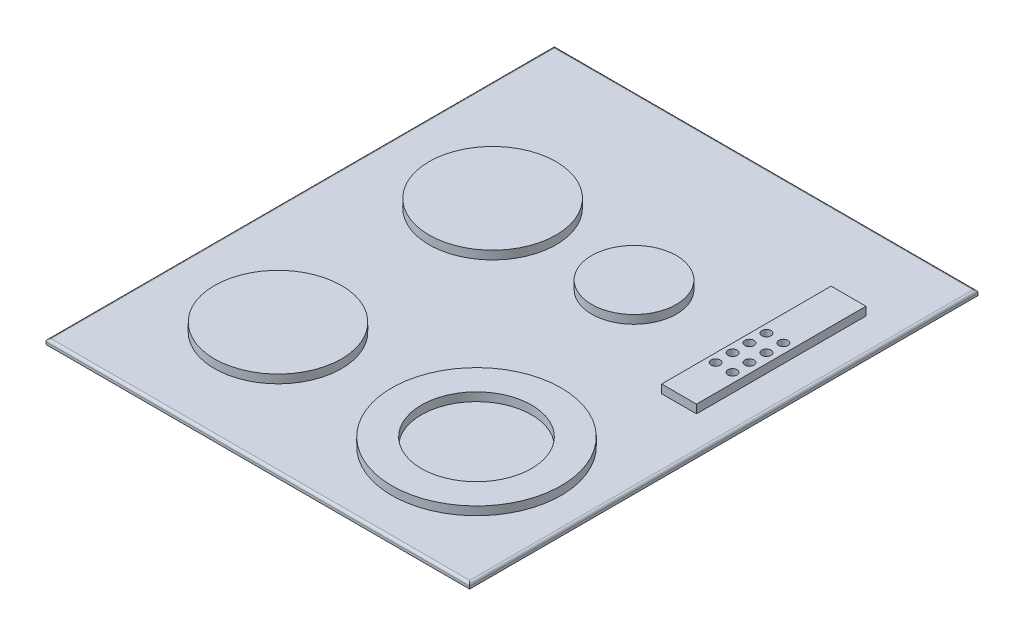
ISO-10303-21;
HEADER;
FILE_DESCRIPTION(('STEP AP214'),'2;1');
FILE_NAME('part.step','',(''),(''),'','','');
FILE_SCHEMA(('AUTOMOTIVE_DESIGN { 1 0 10303 214 1 1 1 1 }'));
ENDSEC;
DATA;
#1=APPLICATION_CONTEXT('core data for automotive mechanical design processes');
#2=APPLICATION_PROTOCOL_DEFINITION('international standard','automotive_design',2000,#1);
#3=PRODUCT_CONTEXT('',#1,'mechanical');
#4=PRODUCT('Part','Part','',(#3));
#5=PRODUCT_RELATED_PRODUCT_CATEGORY('part','',(#4));
#6=PRODUCT_DEFINITION_FORMATION('','',#4);
#7=PRODUCT_DEFINITION_CONTEXT('part definition',#1,'design');
#8=PRODUCT_DEFINITION('design','',#6,#7);
#9=PRODUCT_DEFINITION_SHAPE('','',#8);
#10=(LENGTH_UNIT() NAMED_UNIT(*) SI_UNIT(.MILLI.,.METRE.));
#11=(NAMED_UNIT(*) PLANE_ANGLE_UNIT() SI_UNIT($,.RADIAN.));
#12=(NAMED_UNIT(*) SI_UNIT($,.STERADIAN.) SOLID_ANGLE_UNIT());
#13=UNCERTAINTY_MEASURE_WITH_UNIT(LENGTH_MEASURE(1.E-05),#10,'distance_accuracy_value','');
#14=(GEOMETRIC_REPRESENTATION_CONTEXT(3) GLOBAL_UNCERTAINTY_ASSIGNED_CONTEXT((#13)) GLOBAL_UNIT_ASSIGNED_CONTEXT((#10,
#11,#12)) REPRESENTATION_CONTEXT('',''));
#15=CARTESIAN_POINT('',(0.,0.,0.));
#16=DIRECTION('',(0.,0.,1.));
#17=DIRECTION('',(1.,0.,0.));
#18=AXIS2_PLACEMENT_3D('',#15,#16,#17);
#19=CARTESIAN_POINT('',(0.,0.,0.));
#20=DIRECTION('',(0.,-1.,0.));
#21=DIRECTION('',(0.,0.,-1.));
#22=AXIS2_PLACEMENT_3D('',#19,#20,#21);
#23=PLANE('',#22);
#24=DIRECTION('',(0.,0.,1.));
#25=VECTOR('',#24,1.);
#26=CARTESIAN_POINT('',(0.,0.,0.));
#27=LINE('',#26,#25);
#28=CARTESIAN_POINT('',(0.,0.,-600.));
#29=VERTEX_POINT('',#28);
#30=CARTESIAN_POINT('',(0.,0.,0.));
#31=VERTEX_POINT('',#30);
#32=EDGE_CURVE('E271',#29,#31,#27,.T.);
#33=ORIENTED_EDGE('',*,*,#32,.F.);
#34=DIRECTION('',(-1.,0.,0.));
#35=VECTOR('',#34,1.);
#36=CARTESIAN_POINT('',(0.,0.,-600.));
#37=LINE('',#36,#35);
#38=CARTESIAN_POINT('',(500.,0.,-600.));
#39=VERTEX_POINT('',#38);
#40=EDGE_CURVE('E281',#39,#29,#37,.T.);
#41=ORIENTED_EDGE('',*,*,#40,.F.);
#42=DIRECTION('',(0.,0.,-1.));
#43=VECTOR('',#42,1.);
#44=CARTESIAN_POINT('',(500.,0.,0.));
#45=LINE('',#44,#43);
#46=CARTESIAN_POINT('',(500.,0.,0.));
#47=VERTEX_POINT('',#46);
#48=EDGE_CURVE('E278',#47,#39,#45,.T.);
#49=ORIENTED_EDGE('',*,*,#48,.F.);
#50=DIRECTION('',(1.,0.,0.));
#51=VECTOR('',#50,1.);
#52=CARTESIAN_POINT('',(0.,0.,0.));
#53=LINE('',#52,#51);
#54=EDGE_CURVE('E274',#31,#47,#53,.T.);
#55=ORIENTED_EDGE('',*,*,#54,.F.);
#56=EDGE_LOOP('',(#33,#41,#49,#55));
#57=FACE_BOUND('',#56,.T.);
#58=DIRECTION('',(0.,0.,1.));
#59=VECTOR('',#58,1.);
#60=CARTESIAN_POINT('',(450.,0.,0.));
#61=LINE('',#60,#59);
#62=CARTESIAN_POINT('',(450.,0.,-550.));
#63=VERTEX_POINT('',#62);
#64=CARTESIAN_POINT('',(450.,0.,-50.));
#65=VERTEX_POINT('',#64);
#66=EDGE_CURVE('E255',#63,#65,#61,.T.);
#67=ORIENTED_EDGE('',*,*,#66,.F.);
#68=DIRECTION('',(1.,0.,0.));
#69=VECTOR('',#68,1.);
#70=CARTESIAN_POINT('',(0.,0.,-550.));
#71=LINE('',#70,#69);
#72=CARTESIAN_POINT('',(50.0000000000001,0.,-550.));
#73=VERTEX_POINT('',#72);
#74=EDGE_CURVE('E241',#73,#63,#71,.T.);
#75=ORIENTED_EDGE('',*,*,#74,.F.);
#76=DIRECTION('',(0.,0.,-1.));
#77=VECTOR('',#76,1.);
#78=CARTESIAN_POINT('',(50.,0.,0.));
#79=LINE('',#78,#77);
#80=CARTESIAN_POINT('',(50.,0.,-50.));
#81=VERTEX_POINT('',#80);
#82=EDGE_CURVE('E246',#81,#73,#79,.T.);
#83=ORIENTED_EDGE('',*,*,#82,.F.);
#84=DIRECTION('',(-1.,0.,0.));
#85=VECTOR('',#84,1.);
#86=CARTESIAN_POINT('',(0.,0.,-50.));
#87=LINE('',#86,#85);
#88=EDGE_CURVE('E257',#65,#81,#87,.T.);
#89=ORIENTED_EDGE('',*,*,#88,.F.);
#90=EDGE_LOOP('',(#67,#75,#83,#89));
#91=FACE_BOUND('',#90,.T.);
#92=ADVANCED_FACE('F41',(#57,#91),#23,.T.);
#93=CARTESIAN_POINT('',(0.,6.,0.));
#94=DIRECTION('',(1.,0.,0.));
#95=DIRECTION('',(0.,0.,-1.));
#96=AXIS2_PLACEMENT_3D('',#93,#94,#95);
#97=PLANE('',#96);
#98=DIRECTION('',(0.,-1.,0.));
#99=VECTOR('',#98,1.);
#100=CARTESIAN_POINT('',(0.,6.,0.));
#101=LINE('',#100,#99);
#102=CARTESIAN_POINT('',(0.,3.,0.));
#103=VERTEX_POINT('',#102);
#104=EDGE_CURVE('E290',#103,#31,#101,.T.);
#105=ORIENTED_EDGE('',*,*,#104,.F.);
#106=DIRECTION('',(0.,0.,1.));
#107=VECTOR('',#106,1.);
#108=CARTESIAN_POINT('',(0.,3.,0.));
#109=LINE('',#108,#107);
#110=CARTESIAN_POINT('',(0.,3.,-600.));
#111=VERTEX_POINT('',#110);
#112=EDGE_CURVE('E308',#103,#111,#109,.F.);
#113=ORIENTED_EDGE('',*,*,#112,.T.);
#114=DIRECTION('',(0.,-1.,0.));
#115=VECTOR('',#114,1.);
#116=CARTESIAN_POINT('',(0.,6.,-600.));
#117=LINE('',#116,#115);
#118=EDGE_CURVE('E284',#111,#29,#117,.T.);
#119=ORIENTED_EDGE('',*,*,#118,.T.);
#120=ORIENTED_EDGE('',*,*,#32,.T.);
#121=EDGE_LOOP('',(#105,#113,#119,#120));
#122=FACE_BOUND('',#121,.T.);
#123=ADVANCED_FACE('F367',(#122),#97,.F.);
#124=CARTESIAN_POINT('',(0.,6.,0.));
#125=DIRECTION('',(0.,0.,-1.));
#126=DIRECTION('',(-1.,0.,0.));
#127=AXIS2_PLACEMENT_3D('',#124,#125,#126);
#128=PLANE('',#127);
#129=DIRECTION('',(0.,-1.,0.));
#130=VECTOR('',#129,1.);
#131=CARTESIAN_POINT('',(500.,6.,0.));
#132=LINE('',#131,#130);
#133=CARTESIAN_POINT('',(500.,3.,0.));
#134=VERTEX_POINT('',#133);
#135=EDGE_CURVE('E288',#134,#47,#132,.T.);
#136=ORIENTED_EDGE('',*,*,#135,.F.);
#137=DIRECTION('',(1.,0.,0.));
#138=VECTOR('',#137,1.);
#139=CARTESIAN_POINT('',(0.,3.,0.));
#140=LINE('',#139,#138);
#141=EDGE_CURVE('E306',#134,#103,#140,.F.);
#142=ORIENTED_EDGE('',*,*,#141,.T.);
#143=ORIENTED_EDGE('',*,*,#104,.T.);
#144=ORIENTED_EDGE('',*,*,#54,.T.);
#145=EDGE_LOOP('',(#136,#142,#143,#144));
#146=FACE_BOUND('',#145,.T.);
#147=ADVANCED_FACE('F364',(#146),#128,.F.);
#148=CARTESIAN_POINT('',(500.,6.,0.));
#149=DIRECTION('',(-1.,0.,0.));
#150=DIRECTION('',(0.,0.,1.));
#151=AXIS2_PLACEMENT_3D('',#148,#149,#150);
#152=PLANE('',#151);
#153=DIRECTION('',(0.,-1.,0.));
#154=VECTOR('',#153,1.);
#155=CARTESIAN_POINT('',(500.,6.,-600.));
#156=LINE('',#155,#154);
#157=CARTESIAN_POINT('',(500.,3.,-600.));
#158=VERTEX_POINT('',#157);
#159=EDGE_CURVE('E286',#158,#39,#156,.T.);
#160=ORIENTED_EDGE('',*,*,#159,.F.);
#161=DIRECTION('',(0.,0.,-1.));
#162=VECTOR('',#161,1.);
#163=CARTESIAN_POINT('',(500.,3.,0.));
#164=LINE('',#163,#162);
#165=EDGE_CURVE('E304',#158,#134,#164,.F.);
#166=ORIENTED_EDGE('',*,*,#165,.T.);
#167=ORIENTED_EDGE('',*,*,#135,.T.);
#168=ORIENTED_EDGE('',*,*,#48,.T.);
#169=EDGE_LOOP('',(#160,#166,#167,#168));
#170=FACE_BOUND('',#169,.T.);
#171=ADVANCED_FACE('F376',(#170),#152,.F.);
#172=CARTESIAN_POINT('',(0.,6.,-600.));
#173=DIRECTION('',(0.,0.,1.));
#174=DIRECTION('',(1.,0.,0.));
#175=AXIS2_PLACEMENT_3D('',#172,#173,#174);
#176=PLANE('',#175);
#177=ORIENTED_EDGE('',*,*,#118,.F.);
#178=DIRECTION('',(-1.,0.,0.));
#179=VECTOR('',#178,1.);
#180=CARTESIAN_POINT('',(0.,3.,-600.));
#181=LINE('',#180,#179);
#182=EDGE_CURVE('E301',#111,#158,#181,.F.);
#183=ORIENTED_EDGE('',*,*,#182,.T.);
#184=ORIENTED_EDGE('',*,*,#159,.T.);
#185=ORIENTED_EDGE('',*,*,#40,.T.);
#186=EDGE_LOOP('',(#177,#183,#184,#185));
#187=FACE_BOUND('',#186,.T.);
#188=ADVANCED_FACE('F333',(#187),#176,.F.);
#189=CARTESIAN_POINT('',(0.,6.,0.));
#190=DIRECTION('',(0.,-1.,0.));
#191=DIRECTION('',(0.,0.,-1.));
#192=AXIS2_PLACEMENT_3D('',#189,#190,#191);
#193=PLANE('',#192);
#194=DIRECTION('',(0.,0.,1.));
#195=VECTOR('',#194,1.);
#196=CARTESIAN_POINT('',(419.64670590059,6.,-507.));
#197=LINE('',#196,#195);
#198=CARTESIAN_POINT('',(419.64670590059,6.,-507.));
#199=VERTEX_POINT('',#198);
#200=CARTESIAN_POINT('',(419.64670590059,6.,-307.));
#201=VERTEX_POINT('',#200);
#202=EDGE_CURVE('E139',#199,#201,#197,.T.);
#203=ORIENTED_EDGE('',*,*,#202,.F.);
#204=DIRECTION('',(-1.,0.,0.));
#205=VECTOR('',#204,1.);
#206=CARTESIAN_POINT('',(419.64670590059,6.,-507.));
#207=LINE('',#206,#205);
#208=CARTESIAN_POINT('',(460.751235163329,6.,-507.));
#209=VERTEX_POINT('',#208);
#210=EDGE_CURVE('E143',#209,#199,#207,.T.);
#211=ORIENTED_EDGE('',*,*,#210,.F.);
#212=DIRECTION('',(0.,0.,-1.));
#213=VECTOR('',#212,1.);
#214=CARTESIAN_POINT('',(460.751235163329,6.,-507.));
#215=LINE('',#214,#213);
#216=CARTESIAN_POINT('',(460.751235163329,6.,-307.));
#217=VERTEX_POINT('',#216);
#218=EDGE_CURVE('E62',#217,#209,#215,.T.);
#219=ORIENTED_EDGE('',*,*,#218,.F.);
#220=DIRECTION('',(1.,0.,0.));
#221=VECTOR('',#220,1.);
#222=CARTESIAN_POINT('',(419.64670590059,6.,-307.));
#223=LINE('',#222,#221);
#224=EDGE_CURVE('E57',#201,#217,#223,.T.);
#225=ORIENTED_EDGE('',*,*,#224,.F.);
#226=EDGE_LOOP('',(#203,#211,#219,#225));
#227=FACE_BOUND('',#226,.T.);
#228=CARTESIAN_POINT('',(364.330089407844,6.,-143.740125968399));
#229=DIRECTION('',(0.,-1.,0.));
#230=DIRECTION('',(0.,0.,-1.));
#231=AXIS2_PLACEMENT_3D('',#228,#229,#230);
#232=CIRCLE('',#231,100.);
#233=CARTESIAN_POINT('',(364.330089407844,6.,-243.740125968399));
#234=VERTEX_POINT('',#233);
#235=EDGE_CURVE('E45',#234,#234,#232,.F.);
#236=ORIENTED_EDGE('',*,*,#235,.F.);
#237=EDGE_LOOP('',(#236));
#238=FACE_BOUND('',#237,.T.);
#239=CARTESIAN_POINT('',(130.089337479097,6.,-143.740125968399));
#240=DIRECTION('',(0.,-1.,0.));
#241=DIRECTION('',(0.,0.,-1.));
#242=AXIS2_PLACEMENT_3D('',#239,#240,#241);
#243=CIRCLE('',#242,75.);
#244=CARTESIAN_POINT('',(130.089337479097,6.,-218.740125968399));
#245=VERTEX_POINT('',#244);
#246=EDGE_CURVE('E323',#245,#245,#243,.F.);
#247=ORIENTED_EDGE('',*,*,#246,.F.);
#248=EDGE_LOOP('',(#247));
#249=FACE_BOUND('',#248,.T.);
#250=CARTESIAN_POINT('',(297.,6.,-397.));
#251=DIRECTION('',(0.,-1.,0.));
#252=DIRECTION('',(0.,0.,-1.));
#253=AXIS2_PLACEMENT_3D('',#250,#251,#252);
#254=CIRCLE('',#253,50.);
#255=CARTESIAN_POINT('',(297.,6.,-447.));
#256=VERTEX_POINT('',#255);
#257=EDGE_CURVE('E321',#256,#256,#254,.F.);
#258=ORIENTED_EDGE('',*,*,#257,.F.);
#259=EDGE_LOOP('',(#258));
#260=FACE_BOUND('',#259,.T.);
#261=CARTESIAN_POINT('',(130.089337479097,6.,-397.));
#262=DIRECTION('',(0.,-1.,0.));
#263=DIRECTION('',(0.,0.,-1.));
#264=AXIS2_PLACEMENT_3D('',#261,#262,#263);
#265=CIRCLE('',#264,75.);
#266=CARTESIAN_POINT('',(130.089337479097,6.,-472.));
#267=VERTEX_POINT('',#266);
#268=EDGE_CURVE('E310',#267,#267,#265,.F.);
#269=ORIENTED_EDGE('',*,*,#268,.F.);
#270=EDGE_LOOP('',(#269));
#271=FACE_BOUND('',#270,.T.);
#272=DIRECTION('',(0.,0.,-1.));
#273=VECTOR('',#272,1.);
#274=CARTESIAN_POINT('',(497.,6.,0.));
#275=LINE('',#274,#273);
#276=CARTESIAN_POINT('',(497.,6.,-3.));
#277=VERTEX_POINT('',#276);
#278=CARTESIAN_POINT('',(497.,6.,-597.));
#279=VERTEX_POINT('',#278);
#280=EDGE_CURVE('E296',#277,#279,#275,.T.);
#281=ORIENTED_EDGE('',*,*,#280,.T.);
#282=DIRECTION('',(-1.,0.,0.));
#283=VECTOR('',#282,1.);
#284=CARTESIAN_POINT('',(0.,6.,-597.));
#285=LINE('',#284,#283);
#286=CARTESIAN_POINT('',(3.,6.,-597.));
#287=VERTEX_POINT('',#286);
#288=EDGE_CURVE('E298',#279,#287,#285,.T.);
#289=ORIENTED_EDGE('',*,*,#288,.T.);
#290=DIRECTION('',(0.,0.,1.));
#291=VECTOR('',#290,1.);
#292=CARTESIAN_POINT('',(3.,6.,0.));
#293=LINE('',#292,#291);
#294=CARTESIAN_POINT('',(3.,6.,-3.));
#295=VERTEX_POINT('',#294);
#296=EDGE_CURVE('E292',#287,#295,#293,.T.);
#297=ORIENTED_EDGE('',*,*,#296,.T.);
#298=DIRECTION('',(1.,0.,0.));
#299=VECTOR('',#298,1.);
#300=CARTESIAN_POINT('',(0.,6.,-3.));
#301=LINE('',#300,#299);
#302=EDGE_CURVE('E294',#295,#277,#301,.T.);
#303=ORIENTED_EDGE('',*,*,#302,.T.);
#304=EDGE_LOOP('',(#281,#289,#297,#303));
#305=FACE_BOUND('',#304,.T.);
#306=ADVANCED_FACE('F141',(#227,#238,#249,#260,#271,#305),#193,.F.);
#307=CARTESIAN_POINT('',(0.,3.,-3.));
#308=DIRECTION('',(1.,0.,0.));
#309=DIRECTION('',(0.,0.,-1.));
#310=AXIS2_PLACEMENT_3D('',#307,#308,#309);
#311=CYLINDRICAL_SURFACE('',#310,3.);
#312=CARTESIAN_POINT('',(3.,3.,-3.));
#313=DIRECTION('',(0.707106781186547,0.,0.707106781186547));
#314=DIRECTION('',(-0.707106781186547,0.,0.707106781186547));
#315=AXIS2_PLACEMENT_3D('',#312,#313,#314);
#316=ELLIPSE('',#315,4.24264068711928,3.);
#317=EDGE_CURVE('E314',#103,#295,#316,.F.);
#318=ORIENTED_EDGE('',*,*,#317,.F.);
#319=ORIENTED_EDGE('',*,*,#141,.F.);
#320=CARTESIAN_POINT('',(497.,3.,-3.));
#321=DIRECTION('',(0.707106781186547,0.,-0.707106781186547));
#322=DIRECTION('',(0.707106781186547,0.,0.707106781186547));
#323=AXIS2_PLACEMENT_3D('',#320,#321,#322);
#324=ELLIPSE('',#323,4.24264068711928,3.);
#325=EDGE_CURVE('E275',#277,#134,#324,.T.);
#326=ORIENTED_EDGE('',*,*,#325,.F.);
#327=ORIENTED_EDGE('',*,*,#302,.F.);
#328=EDGE_LOOP('',(#318,#319,#326,#327));
#329=FACE_BOUND('',#328,.T.);
#330=ADVANCED_FACE('F43',(#329),#311,.T.);
#331=CARTESIAN_POINT('',(497.,3.,0.));
#332=DIRECTION('',(0.,0.,-1.));
#333=DIRECTION('',(-1.,0.,0.));
#334=AXIS2_PLACEMENT_3D('',#331,#332,#333);
#335=CYLINDRICAL_SURFACE('',#334,3.);
#336=ORIENTED_EDGE('',*,*,#325,.T.);
#337=ORIENTED_EDGE('',*,*,#165,.F.);
#338=CARTESIAN_POINT('',(497.,3.,-597.));
#339=DIRECTION('',(-0.707106781186547,0.,-0.707106781186547));
#340=DIRECTION('',(0.707106781186547,0.,-0.707106781186547));
#341=AXIS2_PLACEMENT_3D('',#338,#339,#340);
#342=ELLIPSE('',#341,4.24264068711928,3.);
#343=EDGE_CURVE('E312',#279,#158,#342,.T.);
#344=ORIENTED_EDGE('',*,*,#343,.F.);
#345=ORIENTED_EDGE('',*,*,#280,.F.);
#346=EDGE_LOOP('',(#336,#337,#344,#345));
#347=FACE_BOUND('',#346,.T.);
#348=ADVANCED_FACE('F349',(#347),#335,.T.);
#349=CARTESIAN_POINT('',(3.,3.,0.));
#350=DIRECTION('',(0.,0.,1.));
#351=DIRECTION('',(1.,0.,0.));
#352=AXIS2_PLACEMENT_3D('',#349,#350,#351);
#353=CYLINDRICAL_SURFACE('',#352,3.);
#354=ORIENTED_EDGE('',*,*,#317,.T.);
#355=ORIENTED_EDGE('',*,*,#296,.F.);
#356=CARTESIAN_POINT('',(3.,3.,-597.));
#357=DIRECTION('',(-0.707106781186547,0.,0.707106781186547));
#358=DIRECTION('',(0.707106781186547,0.,0.707106781186547));
#359=AXIS2_PLACEMENT_3D('',#356,#357,#358);
#360=ELLIPSE('',#359,4.24264068711928,3.);
#361=EDGE_CURVE('E270',#111,#287,#360,.F.);
#362=ORIENTED_EDGE('',*,*,#361,.F.);
#363=ORIENTED_EDGE('',*,*,#112,.F.);
#364=EDGE_LOOP('',(#354,#355,#362,#363));
#365=FACE_BOUND('',#364,.T.);
#366=ADVANCED_FACE('F357',(#365),#353,.T.);
#367=CARTESIAN_POINT('',(0.,3.,-597.));
#368=DIRECTION('',(-1.,0.,0.));
#369=DIRECTION('',(0.,0.,1.));
#370=AXIS2_PLACEMENT_3D('',#367,#368,#369);
#371=CYLINDRICAL_SURFACE('',#370,3.);
#372=ORIENTED_EDGE('',*,*,#343,.T.);
#373=ORIENTED_EDGE('',*,*,#182,.F.);
#374=ORIENTED_EDGE('',*,*,#361,.T.);
#375=ORIENTED_EDGE('',*,*,#288,.F.);
#376=EDGE_LOOP('',(#372,#373,#374,#375));
#377=FACE_BOUND('',#376,.T.);
#378=ADVANCED_FACE('F352',(#377),#371,.T.);
#379=CARTESIAN_POINT('',(0.,-26.,-550.));
#380=DIRECTION('',(0.,0.,1.));
#381=DIRECTION('',(1.,0.,0.));
#382=AXIS2_PLACEMENT_3D('',#379,#380,#381);
#383=PLANE('',#382);
#384=ORIENTED_EDGE('',*,*,#74,.T.);
#385=DIRECTION('',(0.,1.,0.));
#386=VECTOR('',#385,1.);
#387=CARTESIAN_POINT('',(450.,-26.,-550.));
#388=LINE('',#387,#386);
#389=CARTESIAN_POINT('',(450.,-26.,-550.));
#390=VERTEX_POINT('',#389);
#391=EDGE_CURVE('E268',#390,#63,#388,.T.);
#392=ORIENTED_EDGE('',*,*,#391,.F.);
#393=DIRECTION('',(1.,0.,0.));
#394=VECTOR('',#393,1.);
#395=CARTESIAN_POINT('',(0.,-26.,-550.));
#396=LINE('',#395,#394);
#397=CARTESIAN_POINT('',(50.0000000000001,-26.,-550.));
#398=VERTEX_POINT('',#397);
#399=EDGE_CURVE('E242',#398,#390,#396,.T.);
#400=ORIENTED_EDGE('',*,*,#399,.F.);
#401=DIRECTION('',(0.,1.,0.));
#402=VECTOR('',#401,1.);
#403=CARTESIAN_POINT('',(50.0000000000001,-26.,-550.));
#404=LINE('',#403,#402);
#405=EDGE_CURVE('E252',#398,#73,#404,.T.);
#406=ORIENTED_EDGE('',*,*,#405,.T.);
#407=EDGE_LOOP('',(#384,#392,#400,#406));
#408=FACE_BOUND('',#407,.T.);
#409=ADVANCED_FACE('F391',(#408),#383,.F.);
#410=CARTESIAN_POINT('',(450.,-26.,0.));
#411=DIRECTION('',(-1.,0.,0.));
#412=DIRECTION('',(0.,0.,1.));
#413=AXIS2_PLACEMENT_3D('',#410,#411,#412);
#414=PLANE('',#413);
#415=ORIENTED_EDGE('',*,*,#66,.T.);
#416=DIRECTION('',(0.,1.,0.));
#417=VECTOR('',#416,1.);
#418=CARTESIAN_POINT('',(450.,-26.,-50.));
#419=LINE('',#418,#417);
#420=CARTESIAN_POINT('',(450.,-26.,-50.));
#421=VERTEX_POINT('',#420);
#422=EDGE_CURVE('E265',#421,#65,#419,.T.);
#423=ORIENTED_EDGE('',*,*,#422,.F.);
#424=DIRECTION('',(0.,0.,1.));
#425=VECTOR('',#424,1.);
#426=CARTESIAN_POINT('',(450.,-26.,0.));
#427=LINE('',#426,#425);
#428=EDGE_CURVE('E245',#390,#421,#427,.T.);
#429=ORIENTED_EDGE('',*,*,#428,.F.);
#430=ORIENTED_EDGE('',*,*,#391,.T.);
#431=EDGE_LOOP('',(#415,#423,#429,#430));
#432=FACE_BOUND('',#431,.T.);
#433=ADVANCED_FACE('F394',(#432),#414,.F.);
#434=CARTESIAN_POINT('',(0.,-26.,-50.));
#435=DIRECTION('',(0.,0.,-1.));
#436=DIRECTION('',(-1.,0.,0.));
#437=AXIS2_PLACEMENT_3D('',#434,#435,#436);
#438=PLANE('',#437);
#439=ORIENTED_EDGE('',*,*,#88,.T.);
#440=DIRECTION('',(0.,1.,0.));
#441=VECTOR('',#440,1.);
#442=CARTESIAN_POINT('',(50.,-26.,-50.));
#443=LINE('',#442,#441);
#444=CARTESIAN_POINT('',(50.,-26.,-50.));
#445=VERTEX_POINT('',#444);
#446=EDGE_CURVE('E263',#445,#81,#443,.T.);
#447=ORIENTED_EDGE('',*,*,#446,.F.);
#448=DIRECTION('',(-1.,0.,0.));
#449=VECTOR('',#448,1.);
#450=CARTESIAN_POINT('',(0.,-26.,-50.));
#451=LINE('',#450,#449);
#452=EDGE_CURVE('E248',#421,#445,#451,.T.);
#453=ORIENTED_EDGE('',*,*,#452,.F.);
#454=ORIENTED_EDGE('',*,*,#422,.T.);
#455=EDGE_LOOP('',(#439,#447,#453,#454));
#456=FACE_BOUND('',#455,.T.);
#457=ADVANCED_FACE('F398',(#456),#438,.F.);
#458=CARTESIAN_POINT('',(50.,-26.,0.));
#459=DIRECTION('',(1.,0.,0.));
#460=DIRECTION('',(0.,0.,-1.));
#461=AXIS2_PLACEMENT_3D('',#458,#459,#460);
#462=PLANE('',#461);
#463=ORIENTED_EDGE('',*,*,#82,.T.);
#464=ORIENTED_EDGE('',*,*,#405,.F.);
#465=DIRECTION('',(0.,0.,-1.));
#466=VECTOR('',#465,1.);
#467=CARTESIAN_POINT('',(50.,-26.,0.));
#468=LINE('',#467,#466);
#469=EDGE_CURVE('E250',#445,#398,#468,.T.);
#470=ORIENTED_EDGE('',*,*,#469,.F.);
#471=ORIENTED_EDGE('',*,*,#446,.T.);
#472=EDGE_LOOP('',(#463,#464,#470,#471));
#473=FACE_BOUND('',#472,.T.);
#474=ADVANCED_FACE('F402',(#473),#462,.F.);
#475=CARTESIAN_POINT('',(0.,-26.,0.));
#476=DIRECTION('',(0.,-1.,0.));
#477=DIRECTION('',(0.,0.,-1.));
#478=AXIS2_PLACEMENT_3D('',#475,#476,#477);
#479=PLANE('',#478);
#480=CARTESIAN_POINT('',(250.,-26.,-300.));
#481=DIRECTION('',(0.,-1.,0.));
#482=DIRECTION('',(0.,0.,-1.));
#483=AXIS2_PLACEMENT_3D('',#480,#481,#482);
#484=CIRCLE('',#483,53.966181138013);
#485=CARTESIAN_POINT('',(250.,-26.,-353.966181138013));
#486=VERTEX_POINT('',#485);
#487=EDGE_CURVE('E11',#486,#486,#484,.T.);
#488=ORIENTED_EDGE('',*,*,#487,.F.);
#489=EDGE_LOOP('',(#488));
#490=FACE_BOUND('',#489,.T.);
#491=ORIENTED_EDGE('',*,*,#399,.T.);
#492=ORIENTED_EDGE('',*,*,#428,.T.);
#493=ORIENTED_EDGE('',*,*,#452,.T.);
#494=ORIENTED_EDGE('',*,*,#469,.T.);
#495=EDGE_LOOP('',(#491,#492,#493,#494));
#496=FACE_BOUND('',#495,.T.);
#497=ADVANCED_FACE('F406',(#490,#496),#479,.T.);
#498=CARTESIAN_POINT('',(130.089337479097,16.,-397.));
#499=DIRECTION('',(0.,-1.,0.));
#500=DIRECTION('',(0.,0.,-1.));
#501=AXIS2_PLACEMENT_3D('',#498,#499,#500);
#502=CYLINDRICAL_SURFACE('',#501,75.);
#503=CARTESIAN_POINT('',(130.089337479097,16.,-397.));
#504=DIRECTION('',(0.,1.,0.));
#505=DIRECTION('',(0.,0.,1.));
#506=AXIS2_PLACEMENT_3D('',#503,#504,#505);
#507=CIRCLE('',#506,75.);
#508=CARTESIAN_POINT('',(130.089337479097,16.,-322.));
#509=VERTEX_POINT('',#508);
#510=EDGE_CURVE('E238',#509,#509,#507,.T.);
#511=ORIENTED_EDGE('',*,*,#510,.F.);
#512=EDGE_LOOP('',(#511));
#513=FACE_BOUND('',#512,.T.);
#514=ORIENTED_EDGE('',*,*,#268,.T.);
#515=EDGE_LOOP('',(#514));
#516=FACE_BOUND('',#515,.T.);
#517=ADVANCED_FACE('F410',(#513,#516),#502,.T.);
#518=CARTESIAN_POINT('',(130.089337479097,16.,-397.));
#519=DIRECTION('',(0.,1.,0.));
#520=DIRECTION('',(0.,0.,1.));
#521=AXIS2_PLACEMENT_3D('',#518,#519,#520);
#522=PLANE('',#521);
#523=ORIENTED_EDGE('',*,*,#510,.T.);
#524=EDGE_LOOP('',(#523));
#525=FACE_BOUND('',#524,.T.);
#526=ADVANCED_FACE('F414',(#525),#522,.T.);
#527=CARTESIAN_POINT('',(297.,16.,-397.));
#528=DIRECTION('',(0.,-1.,0.));
#529=DIRECTION('',(0.,0.,-1.));
#530=AXIS2_PLACEMENT_3D('',#527,#528,#529);
#531=CYLINDRICAL_SURFACE('',#530,50.);
#532=CARTESIAN_POINT('',(297.,16.,-397.));
#533=DIRECTION('',(0.,1.,0.));
#534=DIRECTION('',(0.,0.,1.));
#535=AXIS2_PLACEMENT_3D('',#532,#533,#534);
#536=CIRCLE('',#535,50.);
#537=CARTESIAN_POINT('',(297.,16.,-347.));
#538=VERTEX_POINT('',#537);
#539=EDGE_CURVE('E235',#538,#538,#536,.T.);
#540=ORIENTED_EDGE('',*,*,#539,.F.);
#541=EDGE_LOOP('',(#540));
#542=FACE_BOUND('',#541,.T.);
#543=ORIENTED_EDGE('',*,*,#257,.T.);
#544=EDGE_LOOP('',(#543));
#545=FACE_BOUND('',#544,.T.);
#546=ADVANCED_FACE('F418',(#542,#545),#531,.T.);
#547=CARTESIAN_POINT('',(297.,16.,-397.));
#548=DIRECTION('',(0.,1.,0.));
#549=DIRECTION('',(0.,0.,1.));
#550=AXIS2_PLACEMENT_3D('',#547,#548,#549);
#551=PLANE('',#550);
#552=ORIENTED_EDGE('',*,*,#539,.T.);
#553=EDGE_LOOP('',(#552));
#554=FACE_BOUND('',#553,.T.);
#555=ADVANCED_FACE('F420',(#554),#551,.T.);
#556=CARTESIAN_POINT('',(130.089337479097,16.,-143.740125968399));
#557=DIRECTION('',(0.,-1.,0.));
#558=DIRECTION('',(0.,0.,-1.));
#559=AXIS2_PLACEMENT_3D('',#556,#557,#558);
#560=CYLINDRICAL_SURFACE('',#559,75.);
#561=CARTESIAN_POINT('',(130.089337479097,16.,-143.740125968399));
#562=DIRECTION('',(0.,1.,0.));
#563=DIRECTION('',(0.,0.,1.));
#564=AXIS2_PLACEMENT_3D('',#561,#562,#563);
#565=CIRCLE('',#564,75.);
#566=CARTESIAN_POINT('',(130.089337479097,16.,-68.7401259683994));
#567=VERTEX_POINT('',#566);
#568=EDGE_CURVE('E230',#567,#567,#565,.T.);
#569=ORIENTED_EDGE('',*,*,#568,.F.);
#570=EDGE_LOOP('',(#569));
#571=FACE_BOUND('',#570,.T.);
#572=ORIENTED_EDGE('',*,*,#246,.T.);
#573=EDGE_LOOP('',(#572));
#574=FACE_BOUND('',#573,.T.);
#575=ADVANCED_FACE('F423',(#571,#574),#560,.T.);
#576=CARTESIAN_POINT('',(130.089337479097,16.,-143.740125968399));
#577=DIRECTION('',(0.,1.,0.));
#578=DIRECTION('',(0.,0.,1.));
#579=AXIS2_PLACEMENT_3D('',#576,#577,#578);
#580=PLANE('',#579);
#581=ORIENTED_EDGE('',*,*,#568,.T.);
#582=EDGE_LOOP('',(#581));
#583=FACE_BOUND('',#582,.T.);
#584=ADVANCED_FACE('F428',(#583),#580,.T.);
#585=CARTESIAN_POINT('',(364.330089407844,16.,-143.740125968399));
#586=DIRECTION('',(0.,1.,0.));
#587=DIRECTION('',(0.,0.,1.));
#588=AXIS2_PLACEMENT_3D('',#585,#586,#587);
#589=PLANE('',#588);
#590=CARTESIAN_POINT('',(364.330089407844,16.,-143.740125968399));
#591=DIRECTION('',(0.,1.,0.));
#592=DIRECTION('',(0.,0.,1.));
#593=AXIS2_PLACEMENT_3D('',#590,#591,#592);
#594=CIRCLE('',#593,100.);
#595=CARTESIAN_POINT('',(364.330089407844,16.,-43.7401259683995));
#596=VERTEX_POINT('',#595);
#597=EDGE_CURVE('E221',#596,#596,#594,.T.);
#598=ORIENTED_EDGE('',*,*,#597,.T.);
#599=EDGE_LOOP('',(#598));
#600=FACE_BOUND('',#599,.T.);
#601=CARTESIAN_POINT('',(364.330089407844,16.,-143.740125968399));
#602=DIRECTION('',(0.,1.,0.));
#603=DIRECTION('',(0.,0.,1.));
#604=AXIS2_PLACEMENT_3D('',#601,#602,#603);
#605=CIRCLE('',#604,65.);
#606=CARTESIAN_POINT('',(364.330089407844,16.,-78.7401259683995));
#607=VERTEX_POINT('',#606);
#608=EDGE_CURVE('E226',#607,#607,#605,.T.);
#609=ORIENTED_EDGE('',*,*,#608,.F.);
#610=EDGE_LOOP('',(#609));
#611=FACE_BOUND('',#610,.T.);
#612=ADVANCED_FACE('F431',(#600,#611),#589,.T.);
#613=CARTESIAN_POINT('',(364.330089407844,16.,-143.740125968399));
#614=DIRECTION('',(0.,-1.,0.));
#615=DIRECTION('',(0.,0.,-1.));
#616=AXIS2_PLACEMENT_3D('',#613,#614,#615);
#617=CYLINDRICAL_SURFACE('',#616,100.);
#618=ORIENTED_EDGE('',*,*,#597,.F.);
#619=EDGE_LOOP('',(#618));
#620=FACE_BOUND('',#619,.T.);
#621=ORIENTED_EDGE('',*,*,#235,.T.);
#622=EDGE_LOOP('',(#621));
#623=FACE_BOUND('',#622,.T.);
#624=ADVANCED_FACE('F330',(#620,#623),#617,.T.);
#625=CARTESIAN_POINT('',(364.330089407844,16.,-143.740125968399));
#626=DIRECTION('',(0.,-1.,0.));
#627=DIRECTION('',(0.,0.,-1.));
#628=AXIS2_PLACEMENT_3D('',#625,#626,#627);
#629=CYLINDRICAL_SURFACE('',#628,65.);
#630=ORIENTED_EDGE('',*,*,#608,.T.);
#631=EDGE_LOOP('',(#630));
#632=FACE_BOUND('',#631,.T.);
#633=CARTESIAN_POINT('',(364.330089407844,6.,-143.740125968399));
#634=DIRECTION('',(0.,1.,0.));
#635=DIRECTION('',(0.,0.,1.));
#636=AXIS2_PLACEMENT_3D('',#633,#634,#635);
#637=CIRCLE('',#636,65.);
#638=CARTESIAN_POINT('',(364.330089407844,6.,-78.7401259683995));
#639=VERTEX_POINT('',#638);
#640=EDGE_CURVE('E227',#639,#639,#637,.T.);
#641=ORIENTED_EDGE('',*,*,#640,.F.);
#642=EDGE_LOOP('',(#641));
#643=FACE_BOUND('',#642,.T.);
#644=ADVANCED_FACE('F436',(#632,#643),#629,.F.);
#645=ORIENTED_EDGE('',*,*,#640,.T.);
#646=EDGE_LOOP('',(#645));
#647=FACE_BOUND('',#646,.T.);
#648=ADVANCED_FACE('F336',(#647),#193,.F.);
#649=CARTESIAN_POINT('',(0.,16.,0.));
#650=DIRECTION('',(0.,1.,0.));
#651=DIRECTION('',(0.,0.,1.));
#652=AXIS2_PLACEMENT_3D('',#649,#650,#651);
#653=PLANE('',#652);
#654=CARTESIAN_POINT('',(449.543954361207,16.,-380.752043300588));
#655=DIRECTION('',(0.,1.,0.));
#656=DIRECTION('',(0.,0.,1.));
#657=AXIS2_PLACEMENT_3D('',#654,#655,#656);
#658=CIRCLE('',#657,5.39941650934308);
#659=CARTESIAN_POINT('',(449.543954361207,16.,-375.352626791245));
#660=VERTEX_POINT('',#659);
#661=EDGE_CURVE('E209',#660,#660,#658,.T.);
#662=ORIENTED_EDGE('',*,*,#661,.F.);
#663=EDGE_LOOP('',(#662));
#664=FACE_BOUND('',#663,.T.);
#665=CARTESIAN_POINT('',(429.543954361207,16.,-360.752043300588));
#666=DIRECTION('',(0.,1.,0.));
#667=DIRECTION('',(0.,0.,1.));
#668=AXIS2_PLACEMENT_3D('',#665,#666,#667);
#669=CIRCLE('',#668,5.39941650934309);
#670=CARTESIAN_POINT('',(429.543954361207,16.,-355.352626791245));
#671=VERTEX_POINT('',#670);
#672=EDGE_CURVE('E197',#671,#671,#669,.T.);
#673=ORIENTED_EDGE('',*,*,#672,.F.);
#674=EDGE_LOOP('',(#673));
#675=FACE_BOUND('',#674,.T.);
#676=CARTESIAN_POINT('',(429.543954361206,16.,-400.752043300588));
#677=DIRECTION('',(0.,1.,0.));
#678=DIRECTION('',(0.,0.,1.));
#679=AXIS2_PLACEMENT_3D('',#676,#677,#678);
#680=CIRCLE('',#679,5.39941650934308);
#681=CARTESIAN_POINT('',(429.543954361206,16.,-395.352626791245));
#682=VERTEX_POINT('',#681);
#683=EDGE_CURVE('E185',#682,#682,#680,.T.);
#684=ORIENTED_EDGE('',*,*,#683,.F.);
#685=EDGE_LOOP('',(#684));
#686=FACE_BOUND('',#685,.T.);
#687=CARTESIAN_POINT('',(449.543954361206,16.,-420.752043300588));
#688=DIRECTION('',(0.,1.,0.));
#689=DIRECTION('',(0.,0.,1.));
#690=AXIS2_PLACEMENT_3D('',#687,#688,#689);
#691=CIRCLE('',#690,5.39941650934308);
#692=CARTESIAN_POINT('',(449.543954361206,16.,-415.352626791245));
#693=VERTEX_POINT('',#692);
#694=EDGE_CURVE('E147',#693,#693,#691,.T.);
#695=ORIENTED_EDGE('',*,*,#694,.F.);
#696=EDGE_LOOP('',(#695));
#697=FACE_BOUND('',#696,.T.);
#698=DIRECTION('',(0.,0.,1.));
#699=VECTOR('',#698,1.);
#700=CARTESIAN_POINT('',(419.64670590059,16.,-507.));
#701=LINE('',#700,#699);
#702=CARTESIAN_POINT('',(419.64670590059,16.,-507.));
#703=VERTEX_POINT('',#702);
#704=CARTESIAN_POINT('',(419.64670590059,16.,-307.));
#705=VERTEX_POINT('',#704);
#706=EDGE_CURVE('E158',#703,#705,#701,.T.);
#707=ORIENTED_EDGE('',*,*,#706,.T.);
#708=DIRECTION('',(1.,0.,0.));
#709=VECTOR('',#708,1.);
#710=CARTESIAN_POINT('',(419.64670590059,16.,-307.));
#711=LINE('',#710,#709);
#712=CARTESIAN_POINT('',(460.751235163329,16.,-307.));
#713=VERTEX_POINT('',#712);
#714=EDGE_CURVE('E173',#705,#713,#711,.T.);
#715=ORIENTED_EDGE('',*,*,#714,.T.);
#716=DIRECTION('',(0.,0.,-1.));
#717=VECTOR('',#716,1.);
#718=CARTESIAN_POINT('',(460.751235163329,16.,-507.));
#719=LINE('',#718,#717);
#720=CARTESIAN_POINT('',(460.751235163329,16.,-507.));
#721=VERTEX_POINT('',#720);
#722=EDGE_CURVE('E164',#713,#721,#719,.T.);
#723=ORIENTED_EDGE('',*,*,#722,.T.);
#724=DIRECTION('',(-1.,0.,0.));
#725=VECTOR('',#724,1.);
#726=CARTESIAN_POINT('',(419.64670590059,16.,-507.));
#727=LINE('',#726,#725);
#728=EDGE_CURVE('E162',#721,#703,#727,.T.);
#729=ORIENTED_EDGE('',*,*,#728,.T.);
#730=EDGE_LOOP('',(#707,#715,#723,#729));
#731=FACE_BOUND('',#730,.T.);
#732=CARTESIAN_POINT('',(429.543954361206,16.,-420.752043300588));
#733=DIRECTION('',(0.,1.,0.));
#734=DIRECTION('',(0.,0.,1.));
#735=AXIS2_PLACEMENT_3D('',#732,#733,#734);
#736=CIRCLE('',#735,5.39941650934308);
#737=CARTESIAN_POINT('',(429.543954361206,16.,-415.352626791245));
#738=VERTEX_POINT('',#737);
#739=EDGE_CURVE('E179',#738,#738,#736,.T.);
#740=ORIENTED_EDGE('',*,*,#739,.F.);
#741=EDGE_LOOP('',(#740));
#742=FACE_BOUND('',#741,.T.);
#743=CARTESIAN_POINT('',(429.543954361207,16.,-380.752043300588));
#744=DIRECTION('',(0.,1.,0.));
#745=DIRECTION('',(0.,0.,1.));
#746=AXIS2_PLACEMENT_3D('',#743,#744,#745);
#747=CIRCLE('',#746,5.39941650934308);
#748=CARTESIAN_POINT('',(429.543954361207,16.,-375.352626791245));
#749=VERTEX_POINT('',#748);
#750=EDGE_CURVE('E191',#749,#749,#747,.T.);
#751=ORIENTED_EDGE('',*,*,#750,.F.);
#752=EDGE_LOOP('',(#751));
#753=FACE_BOUND('',#752,.T.);
#754=CARTESIAN_POINT('',(449.543954361207,16.,-400.752043300588));
#755=DIRECTION('',(0.,1.,0.));
#756=DIRECTION('',(0.,0.,1.));
#757=AXIS2_PLACEMENT_3D('',#754,#755,#756);
#758=CIRCLE('',#757,5.39941650934308);
#759=CARTESIAN_POINT('',(449.543954361207,16.,-395.352626791245));
#760=VERTEX_POINT('',#759);
#761=EDGE_CURVE('E203',#760,#760,#758,.T.);
#762=ORIENTED_EDGE('',*,*,#761,.F.);
#763=EDGE_LOOP('',(#762));
#764=FACE_BOUND('',#763,.T.);
#765=CARTESIAN_POINT('',(449.543954361207,16.,-360.752043300588));
#766=DIRECTION('',(0.,1.,0.));
#767=DIRECTION('',(0.,0.,1.));
#768=AXIS2_PLACEMENT_3D('',#765,#766,#767);
#769=CIRCLE('',#768,5.39941650934308);
#770=CARTESIAN_POINT('',(449.543954361207,16.,-355.352626791245));
#771=VERTEX_POINT('',#770);
#772=EDGE_CURVE('E215',#771,#771,#769,.T.);
#773=ORIENTED_EDGE('',*,*,#772,.F.);
#774=EDGE_LOOP('',(#773));
#775=FACE_BOUND('',#774,.T.);
#776=ADVANCED_FACE('F479',(#664,#675,#686,#697,#731,#742,#753,#764,#775),#653,.T.);
#777=CARTESIAN_POINT('',(419.64670590059,16.,-507.));
#778=DIRECTION('',(1.,0.,0.));
#779=DIRECTION('',(0.,0.,-1.));
#780=AXIS2_PLACEMENT_3D('',#777,#778,#779);
#781=PLANE('',#780);
#782=ORIENTED_EDGE('',*,*,#202,.T.);
#783=DIRECTION('',(0.,-1.,0.));
#784=VECTOR('',#783,1.);
#785=CARTESIAN_POINT('',(419.64670590059,16.,-307.));
#786=LINE('',#785,#784);
#787=EDGE_CURVE('E508',#705,#201,#786,.T.);
#788=ORIENTED_EDGE('',*,*,#787,.F.);
#789=ORIENTED_EDGE('',*,*,#706,.F.);
#790=DIRECTION('',(0.,-1.,0.));
#791=VECTOR('',#790,1.);
#792=CARTESIAN_POINT('',(419.64670590059,16.,-507.));
#793=LINE('',#792,#791);
#794=EDGE_CURVE('E154',#703,#199,#793,.T.);
#795=ORIENTED_EDGE('',*,*,#794,.T.);
#796=EDGE_LOOP('',(#782,#788,#789,#795));
#797=FACE_BOUND('',#796,.T.);
#798=ADVANCED_FACE('F160',(#797),#781,.F.);
#799=CARTESIAN_POINT('',(419.64670590059,16.,-307.));
#800=DIRECTION('',(0.,0.,-1.));
#801=DIRECTION('',(-1.,0.,0.));
#802=AXIS2_PLACEMENT_3D('',#799,#800,#801);
#803=PLANE('',#802);
#804=ORIENTED_EDGE('',*,*,#224,.T.);
#805=DIRECTION('',(0.,-1.,0.));
#806=VECTOR('',#805,1.);
#807=CARTESIAN_POINT('',(460.751235163329,16.,-307.));
#808=LINE('',#807,#806);
#809=EDGE_CURVE('E166',#713,#217,#808,.T.);
#810=ORIENTED_EDGE('',*,*,#809,.F.);
#811=ORIENTED_EDGE('',*,*,#714,.F.);
#812=ORIENTED_EDGE('',*,*,#787,.T.);
#813=EDGE_LOOP('',(#804,#810,#811,#812));
#814=FACE_BOUND('',#813,.T.);
#815=ADVANCED_FACE('F488',(#814),#803,.F.);
#816=CARTESIAN_POINT('',(460.751235163329,16.,-507.));
#817=DIRECTION('',(-1.,0.,0.));
#818=DIRECTION('',(0.,0.,1.));
#819=AXIS2_PLACEMENT_3D('',#816,#817,#818);
#820=PLANE('',#819);
#821=ORIENTED_EDGE('',*,*,#218,.T.);
#822=DIRECTION('',(0.,-1.,0.));
#823=VECTOR('',#822,1.);
#824=CARTESIAN_POINT('',(460.751235163329,16.,-507.));
#825=LINE('',#824,#823);
#826=EDGE_CURVE('E157',#721,#209,#825,.T.);
#827=ORIENTED_EDGE('',*,*,#826,.F.);
#828=ORIENTED_EDGE('',*,*,#722,.F.);
#829=ORIENTED_EDGE('',*,*,#809,.T.);
#830=EDGE_LOOP('',(#821,#827,#828,#829));
#831=FACE_BOUND('',#830,.T.);
#832=ADVANCED_FACE('F485',(#831),#820,.F.);
#833=CARTESIAN_POINT('',(419.64670590059,16.,-507.));
#834=DIRECTION('',(0.,0.,1.));
#835=DIRECTION('',(1.,0.,0.));
#836=AXIS2_PLACEMENT_3D('',#833,#834,#835);
#837=PLANE('',#836);
#838=ORIENTED_EDGE('',*,*,#210,.T.);
#839=ORIENTED_EDGE('',*,*,#794,.F.);
#840=ORIENTED_EDGE('',*,*,#728,.F.);
#841=ORIENTED_EDGE('',*,*,#826,.T.);
#842=EDGE_LOOP('',(#838,#839,#840,#841));
#843=FACE_BOUND('',#842,.T.);
#844=ADVANCED_FACE('F152',(#843),#837,.F.);
#845=CARTESIAN_POINT('',(449.543954361206,16.,-420.752043300588));
#846=DIRECTION('',(0.,-1.,0.));
#847=DIRECTION('',(0.,0.,-1.));
#848=AXIS2_PLACEMENT_3D('',#845,#846,#847);
#849=CYLINDRICAL_SURFACE('',#848,5.39941650934308);
#850=ORIENTED_EDGE('',*,*,#694,.T.);
#851=EDGE_LOOP('',(#850));
#852=FACE_BOUND('',#851,.T.);
#853=CARTESIAN_POINT('',(449.543954361206,6.,-420.752043300588));
#854=DIRECTION('',(0.,1.,0.));
#855=DIRECTION('',(0.,0.,1.));
#856=AXIS2_PLACEMENT_3D('',#853,#854,#855);
#857=CIRCLE('',#856,5.39941650934308);
#858=CARTESIAN_POINT('',(449.543954361206,6.,-415.352626791245));
#859=VERTEX_POINT('',#858);
#860=EDGE_CURVE('E176',#859,#859,#857,.T.);
#861=ORIENTED_EDGE('',*,*,#860,.F.);
#862=EDGE_LOOP('',(#861));
#863=FACE_BOUND('',#862,.T.);
#864=ADVANCED_FACE('F474',(#852,#863),#849,.F.);
#865=CARTESIAN_POINT('',(429.543954361206,16.,-420.752043300588));
#866=DIRECTION('',(0.,-1.,0.));
#867=DIRECTION('',(0.,0.,-1.));
#868=AXIS2_PLACEMENT_3D('',#865,#866,#867);
#869=CYLINDRICAL_SURFACE('',#868,5.39941650934308);
#870=ORIENTED_EDGE('',*,*,#739,.T.);
#871=EDGE_LOOP('',(#870));
#872=FACE_BOUND('',#871,.T.);
#873=CARTESIAN_POINT('',(429.543954361206,6.,-420.752043300588));
#874=DIRECTION('',(0.,1.,0.));
#875=DIRECTION('',(0.,0.,1.));
#876=AXIS2_PLACEMENT_3D('',#873,#874,#875);
#877=CIRCLE('',#876,5.39941650934308);
#878=CARTESIAN_POINT('',(429.543954361206,6.,-415.352626791245));
#879=VERTEX_POINT('',#878);
#880=EDGE_CURVE('E182',#879,#879,#877,.T.);
#881=ORIENTED_EDGE('',*,*,#880,.F.);
#882=EDGE_LOOP('',(#881));
#883=FACE_BOUND('',#882,.T.);
#884=ADVANCED_FACE('F470',(#872,#883),#869,.F.);
#885=CARTESIAN_POINT('',(429.543954361206,16.,-400.752043300588));
#886=DIRECTION('',(0.,-1.,0.));
#887=DIRECTION('',(0.,0.,-1.));
#888=AXIS2_PLACEMENT_3D('',#885,#886,#887);
#889=CYLINDRICAL_SURFACE('',#888,5.39941650934308);
#890=ORIENTED_EDGE('',*,*,#683,.T.);
#891=EDGE_LOOP('',(#890));
#892=FACE_BOUND('',#891,.T.);
#893=CARTESIAN_POINT('',(429.543954361206,6.,-400.752043300588));
#894=DIRECTION('',(0.,1.,0.));
#895=DIRECTION('',(0.,0.,1.));
#896=AXIS2_PLACEMENT_3D('',#893,#894,#895);
#897=CIRCLE('',#896,5.39941650934308);
#898=CARTESIAN_POINT('',(429.543954361206,6.,-395.352626791245));
#899=VERTEX_POINT('',#898);
#900=EDGE_CURVE('E188',#899,#899,#897,.T.);
#901=ORIENTED_EDGE('',*,*,#900,.F.);
#902=EDGE_LOOP('',(#901));
#903=FACE_BOUND('',#902,.T.);
#904=ADVANCED_FACE('F466',(#892,#903),#889,.F.);
#905=CARTESIAN_POINT('',(429.543954361207,16.,-380.752043300588));
#906=DIRECTION('',(0.,-1.,0.));
#907=DIRECTION('',(0.,0.,-1.));
#908=AXIS2_PLACEMENT_3D('',#905,#906,#907);
#909=CYLINDRICAL_SURFACE('',#908,5.39941650934308);
#910=ORIENTED_EDGE('',*,*,#750,.T.);
#911=EDGE_LOOP('',(#910));
#912=FACE_BOUND('',#911,.T.);
#913=CARTESIAN_POINT('',(429.543954361207,6.,-380.752043300588));
#914=DIRECTION('',(0.,1.,0.));
#915=DIRECTION('',(0.,0.,1.));
#916=AXIS2_PLACEMENT_3D('',#913,#914,#915);
#917=CIRCLE('',#916,5.39941650934308);
#918=CARTESIAN_POINT('',(429.543954361207,6.,-375.352626791245));
#919=VERTEX_POINT('',#918);
#920=EDGE_CURVE('E194',#919,#919,#917,.T.);
#921=ORIENTED_EDGE('',*,*,#920,.F.);
#922=EDGE_LOOP('',(#921));
#923=FACE_BOUND('',#922,.T.);
#924=ADVANCED_FACE('F462',(#912,#923),#909,.F.);
#925=CARTESIAN_POINT('',(429.543954361207,16.,-360.752043300588));
#926=DIRECTION('',(0.,-1.,0.));
#927=DIRECTION('',(0.,0.,-1.));
#928=AXIS2_PLACEMENT_3D('',#925,#926,#927);
#929=CYLINDRICAL_SURFACE('',#928,5.39941650934309);
#930=ORIENTED_EDGE('',*,*,#672,.T.);
#931=EDGE_LOOP('',(#930));
#932=FACE_BOUND('',#931,.T.);
#933=CARTESIAN_POINT('',(429.543954361207,6.,-360.752043300588));
#934=DIRECTION('',(0.,1.,0.));
#935=DIRECTION('',(0.,0.,1.));
#936=AXIS2_PLACEMENT_3D('',#933,#934,#935);
#937=CIRCLE('',#936,5.39941650934309);
#938=CARTESIAN_POINT('',(429.543954361207,6.,-355.352626791245));
#939=VERTEX_POINT('',#938);
#940=EDGE_CURVE('E200',#939,#939,#937,.T.);
#941=ORIENTED_EDGE('',*,*,#940,.F.);
#942=EDGE_LOOP('',(#941));
#943=FACE_BOUND('',#942,.T.);
#944=ADVANCED_FACE('F458',(#932,#943),#929,.F.);
#945=CARTESIAN_POINT('',(449.543954361207,16.,-400.752043300588));
#946=DIRECTION('',(0.,-1.,0.));
#947=DIRECTION('',(0.,0.,-1.));
#948=AXIS2_PLACEMENT_3D('',#945,#946,#947);
#949=CYLINDRICAL_SURFACE('',#948,5.39941650934308);
#950=ORIENTED_EDGE('',*,*,#761,.T.);
#951=EDGE_LOOP('',(#950));
#952=FACE_BOUND('',#951,.T.);
#953=CARTESIAN_POINT('',(449.543954361207,6.,-400.752043300588));
#954=DIRECTION('',(0.,1.,0.));
#955=DIRECTION('',(0.,0.,1.));
#956=AXIS2_PLACEMENT_3D('',#953,#954,#955);
#957=CIRCLE('',#956,5.39941650934308);
#958=CARTESIAN_POINT('',(449.543954361207,6.,-395.352626791245));
#959=VERTEX_POINT('',#958);
#960=EDGE_CURVE('E206',#959,#959,#957,.T.);
#961=ORIENTED_EDGE('',*,*,#960,.F.);
#962=EDGE_LOOP('',(#961));
#963=FACE_BOUND('',#962,.T.);
#964=ADVANCED_FACE('F454',(#952,#963),#949,.F.);
#965=CARTESIAN_POINT('',(449.543954361207,16.,-380.752043300588));
#966=DIRECTION('',(0.,-1.,0.));
#967=DIRECTION('',(0.,0.,-1.));
#968=AXIS2_PLACEMENT_3D('',#965,#966,#967);
#969=CYLINDRICAL_SURFACE('',#968,5.39941650934308);
#970=ORIENTED_EDGE('',*,*,#661,.T.);
#971=EDGE_LOOP('',(#970));
#972=FACE_BOUND('',#971,.T.);
#973=CARTESIAN_POINT('',(449.543954361207,6.,-380.752043300588));
#974=DIRECTION('',(0.,1.,0.));
#975=DIRECTION('',(0.,0.,1.));
#976=AXIS2_PLACEMENT_3D('',#973,#974,#975);
#977=CIRCLE('',#976,5.39941650934308);
#978=CARTESIAN_POINT('',(449.543954361207,6.,-375.352626791245));
#979=VERTEX_POINT('',#978);
#980=EDGE_CURVE('E212',#979,#979,#977,.T.);
#981=ORIENTED_EDGE('',*,*,#980,.F.);
#982=EDGE_LOOP('',(#981));
#983=FACE_BOUND('',#982,.T.);
#984=ADVANCED_FACE('F450',(#972,#983),#969,.F.);
#985=CARTESIAN_POINT('',(449.543954361207,16.,-360.752043300588));
#986=DIRECTION('',(0.,-1.,0.));
#987=DIRECTION('',(0.,0.,-1.));
#988=AXIS2_PLACEMENT_3D('',#985,#986,#987);
#989=CYLINDRICAL_SURFACE('',#988,5.39941650934308);
#990=ORIENTED_EDGE('',*,*,#772,.T.);
#991=EDGE_LOOP('',(#990));
#992=FACE_BOUND('',#991,.T.);
#993=CARTESIAN_POINT('',(449.543954361207,6.,-360.752043300588));
#994=DIRECTION('',(0.,1.,0.));
#995=DIRECTION('',(0.,0.,1.));
#996=AXIS2_PLACEMENT_3D('',#993,#994,#995);
#997=CIRCLE('',#996,5.39941650934308);
#998=CARTESIAN_POINT('',(449.543954361207,6.,-355.352626791245));
#999=VERTEX_POINT('',#998);
#1000=EDGE_CURVE('E218',#999,#999,#997,.T.);
#1001=ORIENTED_EDGE('',*,*,#1000,.F.);
#1002=EDGE_LOOP('',(#1001));
#1003=FACE_BOUND('',#1002,.T.);
#1004=ADVANCED_FACE('F446',(#992,#1003),#989,.F.);
#1005=ORIENTED_EDGE('',*,*,#980,.T.);
#1006=EDGE_LOOP('',(#1005));
#1007=FACE_BOUND('',#1006,.T.);
#1008=ADVANCED_FACE('F449',(#1007),#193,.F.);
#1009=ORIENTED_EDGE('',*,*,#960,.T.);
#1010=EDGE_LOOP('',(#1009));
#1011=FACE_BOUND('',#1010,.T.);
#1012=ADVANCED_FACE('F535',(#1011),#193,.F.);
#1013=ORIENTED_EDGE('',*,*,#940,.T.);
#1014=EDGE_LOOP('',(#1013));
#1015=FACE_BOUND('',#1014,.T.);
#1016=ADVANCED_FACE('F540',(#1015),#193,.F.);
#1017=ORIENTED_EDGE('',*,*,#920,.T.);
#1018=EDGE_LOOP('',(#1017));
#1019=FACE_BOUND('',#1018,.T.);
#1020=ADVANCED_FACE('F547',(#1019),#193,.F.);
#1021=ORIENTED_EDGE('',*,*,#900,.T.);
#1022=EDGE_LOOP('',(#1021));
#1023=FACE_BOUND('',#1022,.T.);
#1024=ADVANCED_FACE('F554',(#1023),#193,.F.);
#1025=ORIENTED_EDGE('',*,*,#880,.T.);
#1026=EDGE_LOOP('',(#1025));
#1027=FACE_BOUND('',#1026,.T.);
#1028=ADVANCED_FACE('F530',(#1027),#193,.F.);
#1029=ORIENTED_EDGE('',*,*,#860,.T.);
#1030=EDGE_LOOP('',(#1029));
#1031=FACE_BOUND('',#1030,.T.);
#1032=ADVANCED_FACE('F335',(#1031),#193,.F.);
#1033=ORIENTED_EDGE('',*,*,#1000,.T.);
#1034=EDGE_LOOP('',(#1033));
#1035=FACE_BOUND('',#1034,.T.);
#1036=ADVANCED_FACE('F499',(#1035),#193,.F.);
#1037=CARTESIAN_POINT('',(250.,-27.,-300.));
#1038=DIRECTION('',(0.,1.,0.));
#1039=DIRECTION('',(0.,0.,1.));
#1040=AXIS2_PLACEMENT_3D('',#1037,#1038,#1039);
#1041=CYLINDRICAL_SURFACE('',#1040,53.966181138013);
#1042=CARTESIAN_POINT('',(250.,-27.,-300.));
#1043=DIRECTION('',(0.,-1.,0.));
#1044=DIRECTION('',(0.,0.,-1.));
#1045=AXIS2_PLACEMENT_3D('',#1042,#1043,#1044);
#1046=CIRCLE('',#1045,53.966181138013);
#1047=CARTESIAN_POINT('',(250.,-27.,-353.966181138013));
#1048=VERTEX_POINT('',#1047);
#1049=EDGE_CURVE('E507',#1048,#1048,#1046,.T.);
#1050=ORIENTED_EDGE('',*,*,#1049,.F.);
#1051=EDGE_LOOP('',(#1050));
#1052=FACE_BOUND('',#1051,.T.);
#1053=ORIENTED_EDGE('',*,*,#487,.T.);
#1054=EDGE_LOOP('',(#1053));
#1055=FACE_BOUND('',#1054,.T.);
#1056=ADVANCED_FACE('F495',(#1052,#1055),#1041,.T.);
#1057=CARTESIAN_POINT('',(250.,-27.,-300.));
#1058=DIRECTION('',(0.,-1.,0.));
#1059=DIRECTION('',(0.,0.,-1.));
#1060=AXIS2_PLACEMENT_3D('',#1057,#1058,#1059);
#1061=PLANE('',#1060);
#1062=ORIENTED_EDGE('',*,*,#1049,.T.);
#1063=EDGE_LOOP('',(#1062));
#1064=FACE_BOUND('',#1063,.T.);
#1065=ADVANCED_FACE('F498',(#1064),#1061,.T.);
#1066=CLOSED_SHELL('',(#92,#123,#147,#171,#188,#306,#330,#348,#366,#378,#409,#433,#457,#474,
#497,#517,#526,#546,#555,#575,#584,#612,#624,#644,#648,#776,#798,#815,#832,#844,#864,#884,#904,
#924,#944,#964,#984,#1004,#1008,#1012,#1016,#1020,#1024,#1028,#1032,#1036,#1056,#1065));
#1067=MANIFOLD_SOLID_BREP('B2',#1066);
#1068=ADVANCED_BREP_SHAPE_REPRESENTATION('',(#18,#1067),#14);
#1069=SHAPE_DEFINITION_REPRESENTATION(#9,#1068);
ENDSEC;
END-ISO-10303-21;
